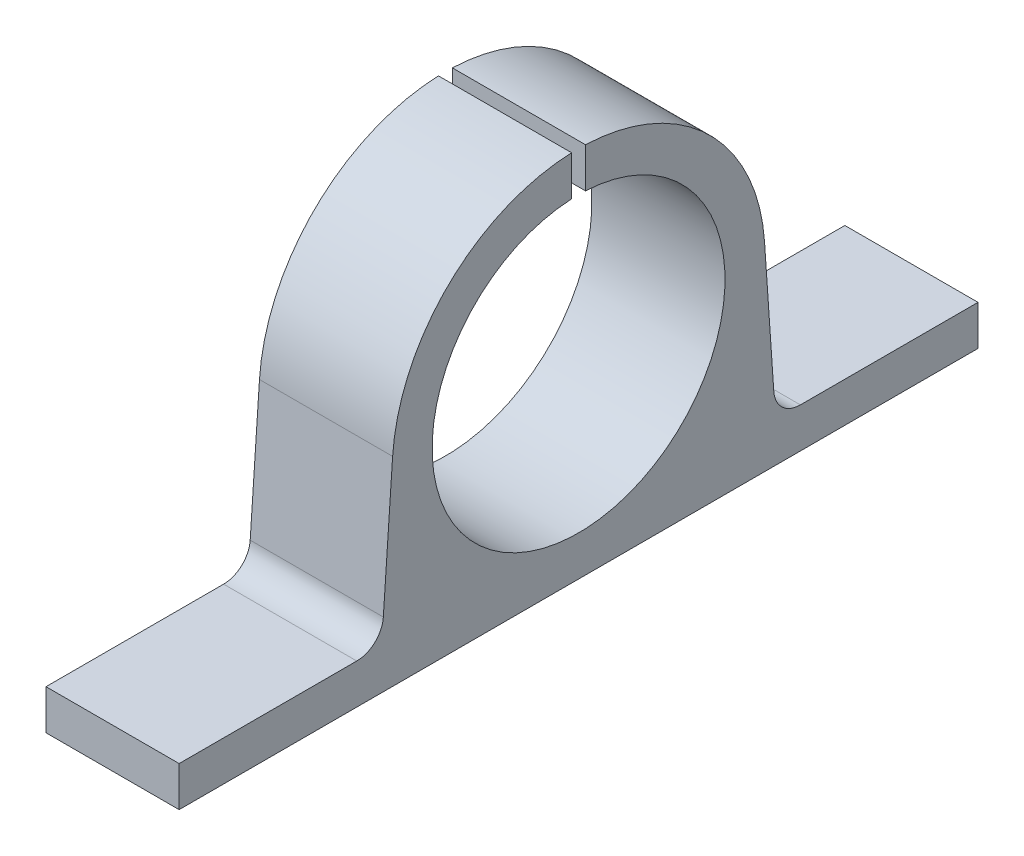
ISO-10303-21;
HEADER;
FILE_DESCRIPTION(('STEP AP214'),'2;1');
FILE_NAME('part.step','',(''),(''),'','','');
FILE_SCHEMA(('AUTOMOTIVE_DESIGN { 1 0 10303 214 1 1 1 1 }'));
ENDSEC;
DATA;
#1=APPLICATION_CONTEXT('core data for automotive mechanical design processes');
#2=APPLICATION_PROTOCOL_DEFINITION('international standard','automotive_design',2000,#1);
#3=PRODUCT_CONTEXT('',#1,'mechanical');
#4=PRODUCT('Part','Part','',(#3));
#5=PRODUCT_RELATED_PRODUCT_CATEGORY('part','',(#4));
#6=PRODUCT_DEFINITION_FORMATION('','',#4);
#7=PRODUCT_DEFINITION_CONTEXT('part definition',#1,'design');
#8=PRODUCT_DEFINITION('design','',#6,#7);
#9=PRODUCT_DEFINITION_SHAPE('','',#8);
#10=(LENGTH_UNIT() NAMED_UNIT(*) SI_UNIT(.MILLI.,.METRE.));
#11=(NAMED_UNIT(*) PLANE_ANGLE_UNIT() SI_UNIT($,.RADIAN.));
#12=(NAMED_UNIT(*) SI_UNIT($,.STERADIAN.) SOLID_ANGLE_UNIT());
#13=UNCERTAINTY_MEASURE_WITH_UNIT(LENGTH_MEASURE(1.E-05),#10,'distance_accuracy_value','');
#14=(GEOMETRIC_REPRESENTATION_CONTEXT(3) GLOBAL_UNCERTAINTY_ASSIGNED_CONTEXT((#13)) GLOBAL_UNIT_ASSIGNED_CONTEXT((#10,
#11,#12)) REPRESENTATION_CONTEXT('',''));
#15=CARTESIAN_POINT('',(0.,0.,0.));
#16=DIRECTION('',(0.,0.,1.));
#17=DIRECTION('',(1.,0.,0.));
#18=AXIS2_PLACEMENT_3D('',#15,#16,#17);
#19=CARTESIAN_POINT('',(-41.0365690573664,14.,0.));
#20=DIRECTION('',(1.,0.,0.));
#21=DIRECTION('',(0.,0.,-1.));
#22=AXIS2_PLACEMENT_3D('',#19,#20,#21);
#23=CYLINDRICAL_SURFACE('',#22,14.);
#24=DIRECTION('',(1.,0.,0.));
#25=VECTOR('',#24,1.);
#26=CARTESIAN_POINT('',(-41.0365690573664,27.9902955282987,0.521182339364157));
#27=LINE('',#26,#25);
#28=CARTESIAN_POINT('',(0.,27.9902955282987,0.521182339364157));
#29=VERTEX_POINT('',#28);
#30=CARTESIAN_POINT('',(10.,27.9902955282987,0.521182339364157));
#31=VERTEX_POINT('',#30);
#32=EDGE_CURVE('E139',#29,#31,#27,.T.);
#33=ORIENTED_EDGE('',*,*,#32,.F.);
#34=CARTESIAN_POINT('',(0.,14.,0.));
#35=DIRECTION('',(-1.,0.,0.));
#36=DIRECTION('',(0.,0.,1.));
#37=AXIS2_PLACEMENT_3D('',#34,#35,#36);
#38=CIRCLE('',#37,14.);
#39=CARTESIAN_POINT('',(0.,14.9643705463183,13.9667458432304));
#40=VERTEX_POINT('',#39);
#41=EDGE_CURVE('E166',#29,#40,#38,.F.);
#42=ORIENTED_EDGE('',*,*,#41,.T.);
#43=DIRECTION('',(1.,0.,0.));
#44=VECTOR('',#43,1.);
#45=CARTESIAN_POINT('',(-41.0365690573664,14.9643705463183,13.9667458432304));
#46=LINE('',#45,#44);
#47=CARTESIAN_POINT('',(10.,14.9643705463183,13.9667458432304));
#48=VERTEX_POINT('',#47);
#49=EDGE_CURVE('E161',#40,#48,#46,.T.);
#50=ORIENTED_EDGE('',*,*,#49,.T.);
#51=CARTESIAN_POINT('',(10.,14.,0.));
#52=DIRECTION('',(1.,0.,0.));
#53=DIRECTION('',(0.,0.,-1.));
#54=AXIS2_PLACEMENT_3D('',#51,#52,#53);
#55=CIRCLE('',#54,14.);
#56=EDGE_CURVE('E153',#31,#48,#55,.T.);
#57=ORIENTED_EDGE('',*,*,#56,.F.);
#58=EDGE_LOOP('',(#33,#42,#50,#57));
#59=FACE_BOUND('',#58,.T.);
#60=ADVANCED_FACE('F41',(#59),#23,.T.);
#61=CARTESIAN_POINT('',(-41.0365690573664,1.03079987136159,14.9288257231679));
#62=DIRECTION('',(0.,-0.0688836104513062,-0.997624703087886));
#63=DIRECTION('',(0.,0.997624703087886,-0.0688836104513062));
#64=AXIS2_PLACEMENT_3D('',#61,#62,#63);
#65=PLANE('',#64);
#66=DIRECTION('',(0.,0.997624703087886,-0.0688836104513062));
#67=VECTOR('',#66,1.);
#68=CARTESIAN_POINT('',(0.,1.03079987136159,14.9288257231679));
#69=LINE('',#68,#67);
#70=CARTESIAN_POINT('',(0.,4.86223277909739,14.664274403348));
#71=VERTEX_POINT('',#70);
#72=EDGE_CURVE('E167',#71,#40,#69,.T.);
#73=ORIENTED_EDGE('',*,*,#72,.F.);
#74=DIRECTION('',(-1.,0.,0.));
#75=VECTOR('',#74,1.);
#76=CARTESIAN_POINT('',(10.,4.86223277909739,14.664274403348));
#77=LINE('',#76,#75);
#78=CARTESIAN_POINT('',(10.,4.86223277909739,14.664274403348));
#79=VERTEX_POINT('',#78);
#80=EDGE_CURVE('E197',#71,#79,#77,.F.);
#81=ORIENTED_EDGE('',*,*,#80,.T.);
#82=DIRECTION('',(0.,0.997624703087886,-0.0688836104513062));
#83=VECTOR('',#82,1.);
#84=CARTESIAN_POINT('',(10.,1.03079987136159,14.9288257231679));
#85=LINE('',#84,#83);
#86=EDGE_CURVE('E170',#79,#48,#85,.T.);
#87=ORIENTED_EDGE('',*,*,#86,.T.);
#88=ORIENTED_EDGE('',*,*,#49,.F.);
#89=EDGE_LOOP('',(#73,#81,#87,#88));
#90=FACE_BOUND('',#89,.T.);
#91=ADVANCED_FACE('F270',(#90),#65,.F.);
#92=CARTESIAN_POINT('',(-41.0365690573664,1.03079987136159,-14.9288257231679));
#93=DIRECTION('',(0.,0.068883610451306,-0.997624703087886));
#94=DIRECTION('',(0.,0.997624703087886,0.068883610451306));
#95=AXIS2_PLACEMENT_3D('',#92,#93,#94);
#96=PLANE('',#95);
#97=DIRECTION('',(0.,0.997624703087886,0.068883610451306));
#98=VECTOR('',#97,1.);
#99=CARTESIAN_POINT('',(10.,1.03079987136159,-14.9288257231679));
#100=LINE('',#99,#98);
#101=CARTESIAN_POINT('',(10.,4.86223277909739,-14.664274403348));
#102=VERTEX_POINT('',#101);
#103=CARTESIAN_POINT('',(10.,14.9643705463183,-13.9667458432304));
#104=VERTEX_POINT('',#103);
#105=EDGE_CURVE('E163',#102,#104,#100,.T.);
#106=ORIENTED_EDGE('',*,*,#105,.F.);
#107=DIRECTION('',(-1.,0.,0.));
#108=VECTOR('',#107,1.);
#109=CARTESIAN_POINT('',(-41.0365690573664,4.86223277909739,-14.664274403348));
#110=LINE('',#109,#108);
#111=CARTESIAN_POINT('',(0.,4.86223277909739,-14.664274403348));
#112=VERTEX_POINT('',#111);
#113=EDGE_CURVE('E188',#102,#112,#110,.T.);
#114=ORIENTED_EDGE('',*,*,#113,.T.);
#115=DIRECTION('',(0.,0.997624703087886,0.068883610451306));
#116=VECTOR('',#115,1.);
#117=CARTESIAN_POINT('',(0.,1.03079987136159,-14.9288257231679));
#118=LINE('',#117,#116);
#119=CARTESIAN_POINT('',(0.,14.9643705463183,-13.9667458432304));
#120=VERTEX_POINT('',#119);
#121=EDGE_CURVE('E176',#112,#120,#118,.T.);
#122=ORIENTED_EDGE('',*,*,#121,.T.);
#123=DIRECTION('',(1.,0.,0.));
#124=VECTOR('',#123,1.);
#125=CARTESIAN_POINT('',(-41.0365690573664,14.9643705463183,-13.9667458432304));
#126=LINE('',#125,#124);
#127=EDGE_CURVE('E178',#120,#104,#126,.T.);
#128=ORIENTED_EDGE('',*,*,#127,.T.);
#129=EDGE_LOOP('',(#106,#114,#122,#128));
#130=FACE_BOUND('',#129,.T.);
#131=ADVANCED_FACE('F281',(#130),#96,.T.);
#132=CARTESIAN_POINT('',(10.,0.,15.));
#133=DIRECTION('',(0.,1.,0.));
#134=DIRECTION('',(0.,0.,1.));
#135=AXIS2_PLACEMENT_3D('',#132,#133,#134);
#136=PLANE('',#135);
#137=DIRECTION('',(0.,0.,-1.));
#138=VECTOR('',#137,1.);
#139=CARTESIAN_POINT('',(0.,0.,15.));
#140=LINE('',#139,#138);
#141=CARTESIAN_POINT('',(0.,0.,30.));
#142=VERTEX_POINT('',#141);
#143=CARTESIAN_POINT('',(0.,0.,-30.));
#144=VERTEX_POINT('',#143);
#145=EDGE_CURVE('E185',#142,#144,#140,.T.);
#146=ORIENTED_EDGE('',*,*,#145,.T.);
#147=DIRECTION('',(1.,0.,0.));
#148=VECTOR('',#147,1.);
#149=CARTESIAN_POINT('',(0.,0.,-30.));
#150=LINE('',#149,#148);
#151=CARTESIAN_POINT('',(10.,0.,-30.));
#152=VERTEX_POINT('',#151);
#153=EDGE_CURVE('E214',#144,#152,#150,.T.);
#154=ORIENTED_EDGE('',*,*,#153,.T.);
#155=DIRECTION('',(0.,0.,-1.));
#156=VECTOR('',#155,1.);
#157=CARTESIAN_POINT('',(10.,0.,15.));
#158=LINE('',#157,#156);
#159=CARTESIAN_POINT('',(10.,0.,30.));
#160=VERTEX_POINT('',#159);
#161=EDGE_CURVE('E186',#160,#152,#158,.T.);
#162=ORIENTED_EDGE('',*,*,#161,.F.);
#163=DIRECTION('',(-1.,0.,0.));
#164=VECTOR('',#163,1.);
#165=CARTESIAN_POINT('',(0.,0.,30.));
#166=LINE('',#165,#164);
#167=EDGE_CURVE('E217',#160,#142,#166,.T.);
#168=ORIENTED_EDGE('',*,*,#167,.T.);
#169=EDGE_LOOP('',(#146,#154,#162,#168));
#170=FACE_BOUND('',#169,.T.);
#171=ADVANCED_FACE('F254',(#170),#136,.F.);
#172=CARTESIAN_POINT('',(10.,14.,0.));
#173=DIRECTION('',(-1.,0.,0.));
#174=DIRECTION('',(0.,0.,1.));
#175=AXIS2_PLACEMENT_3D('',#172,#173,#174);
#176=PLANE('',#175);
#177=CARTESIAN_POINT('',(10.,14.,0.));
#178=DIRECTION('',(1.,0.,0.));
#179=DIRECTION('',(0.,0.,-1.));
#180=AXIS2_PLACEMENT_3D('',#177,#178,#179);
#181=CIRCLE('',#180,11.);
#182=CARTESIAN_POINT('',(10.,24.9876461978503,0.521182339364157));
#183=VERTEX_POINT('',#182);
#184=CARTESIAN_POINT('',(10.,24.9876461978503,-0.521182339364157));
#185=VERTEX_POINT('',#184);
#186=EDGE_CURVE('E146',#183,#185,#181,.T.);
#187=ORIENTED_EDGE('',*,*,#186,.F.);
#188=DIRECTION('',(0.,-1.,0.));
#189=VECTOR('',#188,1.);
#190=CARTESIAN_POINT('',(10.,29.1887424614698,0.521182339364157));
#191=LINE('',#190,#189);
#192=EDGE_CURVE('E56',#31,#183,#191,.T.);
#193=ORIENTED_EDGE('',*,*,#192,.F.);
#194=ORIENTED_EDGE('',*,*,#56,.T.);
#195=ORIENTED_EDGE('',*,*,#86,.F.);
#196=CARTESIAN_POINT('',(10.,5.,16.6595238095238));
#197=DIRECTION('',(-1.,0.,0.));
#198=DIRECTION('',(0.,0.,1.));
#199=AXIS2_PLACEMENT_3D('',#196,#197,#198);
#200=CIRCLE('',#199,2.);
#201=CARTESIAN_POINT('',(10.,3.,16.6595238095238));
#202=VERTEX_POINT('',#201);
#203=EDGE_CURVE('E205',#79,#202,#200,.T.);
#204=ORIENTED_EDGE('',*,*,#203,.T.);
#205=DIRECTION('',(0.,0.,1.));
#206=VECTOR('',#205,1.);
#207=CARTESIAN_POINT('',(10.,3.,30.));
#208=LINE('',#207,#206);
#209=CARTESIAN_POINT('',(10.,3.,30.));
#210=VERTEX_POINT('',#209);
#211=EDGE_CURVE('E229',#202,#210,#208,.T.);
#212=ORIENTED_EDGE('',*,*,#211,.T.);
#213=DIRECTION('',(0.,-1.,0.));
#214=VECTOR('',#213,1.);
#215=CARTESIAN_POINT('',(10.,3.,30.));
#216=LINE('',#215,#214);
#217=EDGE_CURVE('E241',#210,#160,#216,.T.);
#218=ORIENTED_EDGE('',*,*,#217,.T.);
#219=ORIENTED_EDGE('',*,*,#161,.T.);
#220=DIRECTION('',(0.,-1.,0.));
#221=VECTOR('',#220,1.);
#222=CARTESIAN_POINT('',(10.,3.,-30.));
#223=LINE('',#222,#221);
#224=CARTESIAN_POINT('',(10.,3.,-30.));
#225=VERTEX_POINT('',#224);
#226=EDGE_CURVE('E244',#225,#152,#223,.T.);
#227=ORIENTED_EDGE('',*,*,#226,.F.);
#228=CARTESIAN_POINT('',(10.,3.,-16.6595238095238));
#229=VERTEX_POINT('',#228);
#230=EDGE_CURVE('E230',#225,#229,#208,.T.);
#231=ORIENTED_EDGE('',*,*,#230,.T.);
#232=CARTESIAN_POINT('',(10.,5.,-16.6595238095238));
#233=DIRECTION('',(-1.,0.,0.));
#234=DIRECTION('',(0.,0.,1.));
#235=AXIS2_PLACEMENT_3D('',#232,#233,#234);
#236=CIRCLE('',#235,2.);
#237=EDGE_CURVE('E201',#229,#102,#236,.T.);
#238=ORIENTED_EDGE('',*,*,#237,.T.);
#239=ORIENTED_EDGE('',*,*,#105,.T.);
#240=CARTESIAN_POINT('',(10.,27.9902955282987,-0.521182339364157));
#241=VERTEX_POINT('',#240);
#242=EDGE_CURVE('E162',#104,#241,#55,.T.);
#243=ORIENTED_EDGE('',*,*,#242,.T.);
#244=DIRECTION('',(0.,1.,0.));
#245=VECTOR('',#244,1.);
#246=CARTESIAN_POINT('',(10.,29.1887424614698,-0.521182339364157));
#247=LINE('',#246,#245);
#248=EDGE_CURVE('E157',#185,#241,#247,.T.);
#249=ORIENTED_EDGE('',*,*,#248,.F.);
#250=EDGE_LOOP('',(#187,#193,#194,#195,#204,#212,#218,#219,#227,#231,#238,#239,#243,#249));
#251=FACE_BOUND('',#250,.T.);
#252=ADVANCED_FACE('F151',(#251),#176,.F.);
#253=CARTESIAN_POINT('',(0.,14.,0.));
#254=DIRECTION('',(-1.,0.,0.));
#255=DIRECTION('',(0.,0.,1.));
#256=AXIS2_PLACEMENT_3D('',#253,#254,#255);
#257=PLANE('',#256);
#258=DIRECTION('',(0.,-1.,0.));
#259=VECTOR('',#258,1.);
#260=CARTESIAN_POINT('',(0.,29.1887424614698,0.521182339364157));
#261=LINE('',#260,#259);
#262=CARTESIAN_POINT('',(0.,24.9876461978503,0.521182339364157));
#263=VERTEX_POINT('',#262);
#264=EDGE_CURVE('E142',#29,#263,#261,.T.);
#265=ORIENTED_EDGE('',*,*,#264,.T.);
#266=CARTESIAN_POINT('',(0.,14.,0.));
#267=DIRECTION('',(1.,0.,0.));
#268=DIRECTION('',(0.,0.,-1.));
#269=AXIS2_PLACEMENT_3D('',#266,#267,#268);
#270=CIRCLE('',#269,11.);
#271=CARTESIAN_POINT('',(0.,24.9876461978503,-0.521182339364157));
#272=VERTEX_POINT('',#271);
#273=EDGE_CURVE('E210',#263,#272,#270,.T.);
#274=ORIENTED_EDGE('',*,*,#273,.T.);
#275=DIRECTION('',(0.,1.,0.));
#276=VECTOR('',#275,1.);
#277=CARTESIAN_POINT('',(0.,29.1887424614698,-0.521182339364157));
#278=LINE('',#277,#276);
#279=CARTESIAN_POINT('',(0.,27.9902955282987,-0.521182339364157));
#280=VERTEX_POINT('',#279);
#281=EDGE_CURVE('E63',#272,#280,#278,.T.);
#282=ORIENTED_EDGE('',*,*,#281,.T.);
#283=EDGE_CURVE('E173',#120,#280,#38,.F.);
#284=ORIENTED_EDGE('',*,*,#283,.F.);
#285=ORIENTED_EDGE('',*,*,#121,.F.);
#286=CARTESIAN_POINT('',(0.,5.,-16.6595238095238));
#287=DIRECTION('',(-1.,0.,0.));
#288=DIRECTION('',(0.,0.,1.));
#289=AXIS2_PLACEMENT_3D('',#286,#287,#288);
#290=CIRCLE('',#289,2.);
#291=CARTESIAN_POINT('',(0.,3.,-16.6595238095238));
#292=VERTEX_POINT('',#291);
#293=EDGE_CURVE('E199',#112,#292,#290,.F.);
#294=ORIENTED_EDGE('',*,*,#293,.T.);
#295=DIRECTION('',(0.,0.,-1.));
#296=VECTOR('',#295,1.);
#297=CARTESIAN_POINT('',(0.,3.,30.));
#298=LINE('',#297,#296);
#299=CARTESIAN_POINT('',(0.,3.,-30.));
#300=VERTEX_POINT('',#299);
#301=EDGE_CURVE('E226',#292,#300,#298,.T.);
#302=ORIENTED_EDGE('',*,*,#301,.T.);
#303=DIRECTION('',(0.,-1.,0.));
#304=VECTOR('',#303,1.);
#305=CARTESIAN_POINT('',(0.,3.,-30.));
#306=LINE('',#305,#304);
#307=EDGE_CURVE('E235',#300,#144,#306,.T.);
#308=ORIENTED_EDGE('',*,*,#307,.T.);
#309=ORIENTED_EDGE('',*,*,#145,.F.);
#310=DIRECTION('',(0.,-1.,0.));
#311=VECTOR('',#310,1.);
#312=CARTESIAN_POINT('',(0.,3.,30.));
#313=LINE('',#312,#311);
#314=CARTESIAN_POINT('',(0.,3.,30.));
#315=VERTEX_POINT('',#314);
#316=EDGE_CURVE('E181',#315,#142,#313,.T.);
#317=ORIENTED_EDGE('',*,*,#316,.F.);
#318=CARTESIAN_POINT('',(0.,3.,16.6595238095238));
#319=VERTEX_POINT('',#318);
#320=EDGE_CURVE('E222',#315,#319,#298,.T.);
#321=ORIENTED_EDGE('',*,*,#320,.T.);
#322=CARTESIAN_POINT('',(0.,5.,16.6595238095238));
#323=DIRECTION('',(-1.,0.,0.));
#324=DIRECTION('',(0.,0.,1.));
#325=AXIS2_PLACEMENT_3D('',#322,#323,#324);
#326=CIRCLE('',#325,2.);
#327=EDGE_CURVE('E203',#319,#71,#326,.F.);
#328=ORIENTED_EDGE('',*,*,#327,.T.);
#329=ORIENTED_EDGE('',*,*,#72,.T.);
#330=ORIENTED_EDGE('',*,*,#41,.F.);
#331=EDGE_LOOP('',(#265,#274,#282,#284,#285,#294,#302,#308,#309,#317,#321,#328,#329,#330));
#332=FACE_BOUND('',#331,.T.);
#333=ADVANCED_FACE('F212',(#332),#257,.T.);
#334=DIRECTION('',(1.,0.,0.));
#335=VECTOR('',#334,1.);
#336=CARTESIAN_POINT('',(-41.0365690573664,27.9902955282987,-0.521182339364157));
#337=LINE('',#336,#335);
#338=EDGE_CURVE('E147',#241,#280,#337,.F.);
#339=ORIENTED_EDGE('',*,*,#338,.F.);
#340=ORIENTED_EDGE('',*,*,#242,.F.);
#341=ORIENTED_EDGE('',*,*,#127,.F.);
#342=ORIENTED_EDGE('',*,*,#283,.T.);
#343=EDGE_LOOP('',(#339,#340,#341,#342));
#344=FACE_BOUND('',#343,.T.);
#345=ADVANCED_FACE('F287',(#344),#23,.T.);
#346=CARTESIAN_POINT('',(0.,3.,-30.));
#347=DIRECTION('',(0.,0.,-1.));
#348=DIRECTION('',(-1.,0.,0.));
#349=AXIS2_PLACEMENT_3D('',#346,#347,#348);
#350=PLANE('',#349);
#351=ORIENTED_EDGE('',*,*,#153,.F.);
#352=ORIENTED_EDGE('',*,*,#307,.F.);
#353=DIRECTION('',(1.,0.,0.));
#354=VECTOR('',#353,1.);
#355=CARTESIAN_POINT('',(0.,3.,-30.));
#356=LINE('',#355,#354);
#357=EDGE_CURVE('E225',#300,#225,#356,.T.);
#358=ORIENTED_EDGE('',*,*,#357,.T.);
#359=ORIENTED_EDGE('',*,*,#226,.T.);
#360=EDGE_LOOP('',(#351,#352,#358,#359));
#361=FACE_BOUND('',#360,.T.);
#362=ADVANCED_FACE('F252',(#361),#350,.T.);
#363=CARTESIAN_POINT('',(0.,3.,0.));
#364=DIRECTION('',(0.,-1.,0.));
#365=DIRECTION('',(0.,0.,-1.));
#366=AXIS2_PLACEMENT_3D('',#363,#364,#365);
#367=PLANE('',#366);
#368=ORIENTED_EDGE('',*,*,#301,.F.);
#369=DIRECTION('',(-1.,0.,0.));
#370=VECTOR('',#369,1.);
#371=CARTESIAN_POINT('',(0.,3.,-16.6595238095238));
#372=LINE('',#371,#370);
#373=EDGE_CURVE('E192',#292,#229,#372,.F.);
#374=ORIENTED_EDGE('',*,*,#373,.T.);
#375=ORIENTED_EDGE('',*,*,#230,.F.);
#376=ORIENTED_EDGE('',*,*,#357,.F.);
#377=EDGE_LOOP('',(#368,#374,#375,#376));
#378=FACE_BOUND('',#377,.T.);
#379=ADVANCED_FACE('F274',(#378),#367,.F.);
#380=ORIENTED_EDGE('',*,*,#211,.F.);
#381=DIRECTION('',(-1.,0.,0.));
#382=VECTOR('',#381,1.);
#383=CARTESIAN_POINT('',(0.,3.,16.6595238095238));
#384=LINE('',#383,#382);
#385=EDGE_CURVE('E194',#202,#319,#384,.T.);
#386=ORIENTED_EDGE('',*,*,#385,.T.);
#387=ORIENTED_EDGE('',*,*,#320,.F.);
#388=DIRECTION('',(-1.,0.,0.));
#389=VECTOR('',#388,1.);
#390=CARTESIAN_POINT('',(0.,3.,30.));
#391=LINE('',#390,#389);
#392=EDGE_CURVE('E233',#210,#315,#391,.T.);
#393=ORIENTED_EDGE('',*,*,#392,.F.);
#394=EDGE_LOOP('',(#380,#386,#387,#393));
#395=FACE_BOUND('',#394,.T.);
#396=ADVANCED_FACE('F263',(#395),#367,.F.);
#397=CARTESIAN_POINT('',(0.,3.,30.));
#398=DIRECTION('',(0.,0.,1.));
#399=DIRECTION('',(1.,0.,0.));
#400=AXIS2_PLACEMENT_3D('',#397,#398,#399);
#401=PLANE('',#400);
#402=ORIENTED_EDGE('',*,*,#167,.F.);
#403=ORIENTED_EDGE('',*,*,#217,.F.);
#404=ORIENTED_EDGE('',*,*,#392,.T.);
#405=ORIENTED_EDGE('',*,*,#316,.T.);
#406=EDGE_LOOP('',(#402,#403,#404,#405));
#407=FACE_BOUND('',#406,.T.);
#408=ADVANCED_FACE('F258',(#407),#401,.T.);
#409=CARTESIAN_POINT('',(-41.0365690573664,5.,-16.6595238095238));
#410=DIRECTION('',(-1.,0.,0.));
#411=DIRECTION('',(0.,0.,1.));
#412=AXIS2_PLACEMENT_3D('',#409,#410,#411);
#413=CYLINDRICAL_SURFACE('',#412,2.);
#414=ORIENTED_EDGE('',*,*,#237,.F.);
#415=ORIENTED_EDGE('',*,*,#373,.F.);
#416=ORIENTED_EDGE('',*,*,#293,.F.);
#417=ORIENTED_EDGE('',*,*,#113,.F.);
#418=EDGE_LOOP('',(#414,#415,#416,#417));
#419=FACE_BOUND('',#418,.T.);
#420=ADVANCED_FACE('F277',(#419),#413,.F.);
#421=CARTESIAN_POINT('',(0.,5.,16.6595238095238));
#422=DIRECTION('',(1.,0.,0.));
#423=DIRECTION('',(0.,0.,-1.));
#424=AXIS2_PLACEMENT_3D('',#421,#422,#423);
#425=CYLINDRICAL_SURFACE('',#424,2.);
#426=ORIENTED_EDGE('',*,*,#203,.F.);
#427=ORIENTED_EDGE('',*,*,#80,.F.);
#428=ORIENTED_EDGE('',*,*,#327,.F.);
#429=ORIENTED_EDGE('',*,*,#385,.F.);
#430=EDGE_LOOP('',(#426,#427,#428,#429));
#431=FACE_BOUND('',#430,.T.);
#432=ADVANCED_FACE('F43',(#431),#425,.F.);
#433=CARTESIAN_POINT('',(0.,14.,0.));
#434=DIRECTION('',(1.,0.,0.));
#435=DIRECTION('',(0.,0.,-1.));
#436=AXIS2_PLACEMENT_3D('',#433,#434,#435);
#437=CYLINDRICAL_SURFACE('',#436,11.);
#438=ORIENTED_EDGE('',*,*,#273,.F.);
#439=DIRECTION('',(1.,0.,0.));
#440=VECTOR('',#439,1.);
#441=CARTESIAN_POINT('',(0.,24.9876461978503,0.521182339364157));
#442=LINE('',#441,#440);
#443=EDGE_CURVE('E11',#263,#183,#442,.T.);
#444=ORIENTED_EDGE('',*,*,#443,.T.);
#445=ORIENTED_EDGE('',*,*,#186,.T.);
#446=DIRECTION('',(1.,0.,0.));
#447=VECTOR('',#446,1.);
#448=CARTESIAN_POINT('',(0.,24.9876461978503,-0.521182339364157));
#449=LINE('',#448,#447);
#450=EDGE_CURVE('E49',#185,#272,#449,.F.);
#451=ORIENTED_EDGE('',*,*,#450,.T.);
#452=EDGE_LOOP('',(#438,#444,#445,#451));
#453=FACE_BOUND('',#452,.T.);
#454=ADVANCED_FACE('F209',(#453),#437,.F.);
#455=CARTESIAN_POINT('',(0.,29.1887424614698,-0.521182339364157));
#456=DIRECTION('',(0.,0.,-1.));
#457=DIRECTION('',(-1.,0.,0.));
#458=AXIS2_PLACEMENT_3D('',#455,#456,#457);
#459=PLANE('',#458);
#460=ORIENTED_EDGE('',*,*,#338,.T.);
#461=ORIENTED_EDGE('',*,*,#281,.F.);
#462=ORIENTED_EDGE('',*,*,#450,.F.);
#463=ORIENTED_EDGE('',*,*,#248,.T.);
#464=EDGE_LOOP('',(#460,#461,#462,#463));
#465=FACE_BOUND('',#464,.T.);
#466=ADVANCED_FACE('F291',(#465),#459,.F.);
#467=CARTESIAN_POINT('',(0.,29.1887424614698,0.521182339364157));
#468=DIRECTION('',(0.,0.,1.));
#469=DIRECTION('',(1.,0.,0.));
#470=AXIS2_PLACEMENT_3D('',#467,#468,#469);
#471=PLANE('',#470);
#472=ORIENTED_EDGE('',*,*,#32,.T.);
#473=ORIENTED_EDGE('',*,*,#192,.T.);
#474=ORIENTED_EDGE('',*,*,#443,.F.);
#475=ORIENTED_EDGE('',*,*,#264,.F.);
#476=EDGE_LOOP('',(#472,#473,#474,#475));
#477=FACE_BOUND('',#476,.T.);
#478=ADVANCED_FACE('F140',(#477),#471,.F.);
#479=CLOSED_SHELL('',(#60,#91,#131,#171,#252,#333,#345,#362,#379,#396,#408,#420,#432,#454,#466,#478));
#480=MANIFOLD_SOLID_BREP('B2',#479);
#481=ADVANCED_BREP_SHAPE_REPRESENTATION('',(#18,#480),#14);
#482=SHAPE_DEFINITION_REPRESENTATION(#9,#481);
ENDSEC;
END-ISO-10303-21;
